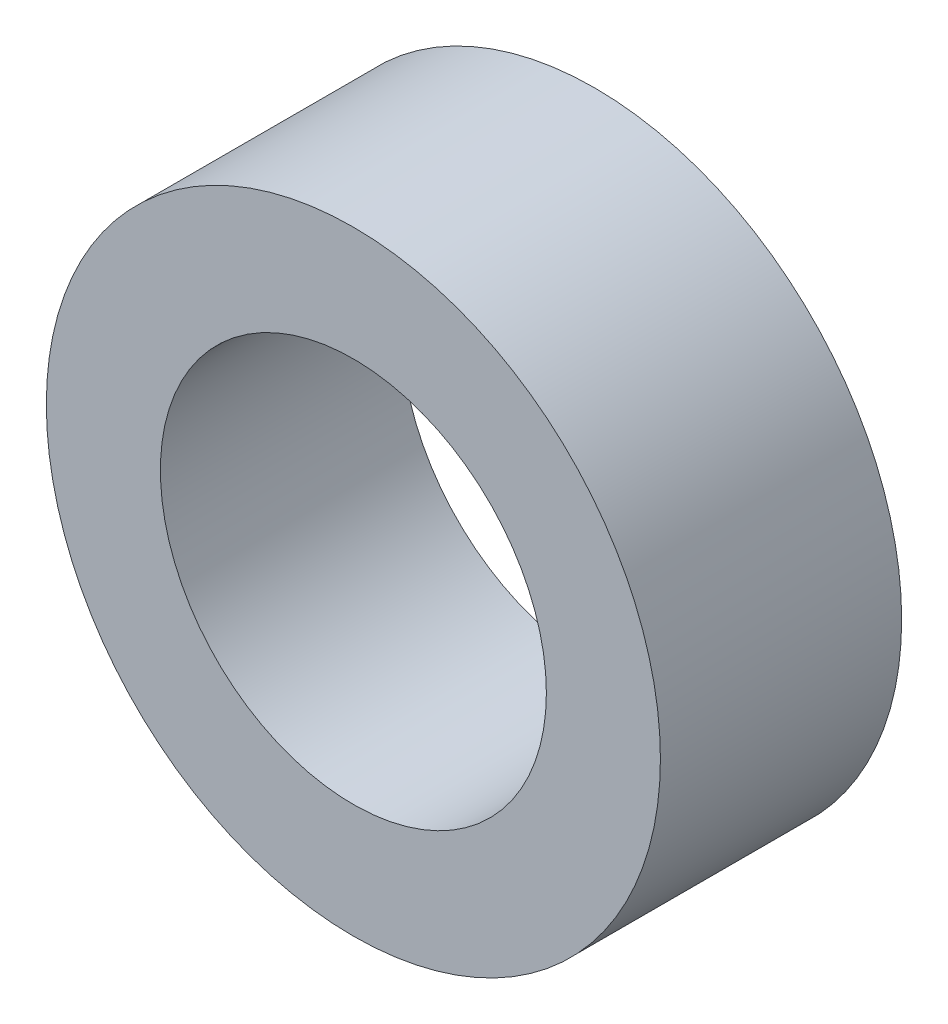
ISO-10303-21;
HEADER;
FILE_DESCRIPTION(('STEP AP214'),'2;1');
FILE_NAME('part.step','',(''),(''),'','','');
FILE_SCHEMA(('AUTOMOTIVE_DESIGN { 1 0 10303 214 1 1 1 1 }'));
ENDSEC;
DATA;
#1=APPLICATION_CONTEXT('core data for automotive mechanical design processes');
#2=APPLICATION_PROTOCOL_DEFINITION('international standard','automotive_design',2000,#1);
#3=PRODUCT_CONTEXT('',#1,'mechanical');
#4=PRODUCT('Part','Part','',(#3));
#5=PRODUCT_RELATED_PRODUCT_CATEGORY('part','',(#4));
#6=PRODUCT_DEFINITION_FORMATION('','',#4);
#7=PRODUCT_DEFINITION_CONTEXT('part definition',#1,'design');
#8=PRODUCT_DEFINITION('design','',#6,#7);
#9=PRODUCT_DEFINITION_SHAPE('','',#8);
#10=(LENGTH_UNIT() NAMED_UNIT(*) SI_UNIT(.MILLI.,.METRE.));
#11=(NAMED_UNIT(*) PLANE_ANGLE_UNIT() SI_UNIT($,.RADIAN.));
#12=(NAMED_UNIT(*) SI_UNIT($,.STERADIAN.) SOLID_ANGLE_UNIT());
#13=UNCERTAINTY_MEASURE_WITH_UNIT(LENGTH_MEASURE(1.E-05),#10,'distance_accuracy_value','');
#14=(GEOMETRIC_REPRESENTATION_CONTEXT(3) GLOBAL_UNCERTAINTY_ASSIGNED_CONTEXT((#13)) GLOBAL_UNIT_ASSIGNED_CONTEXT((#10,
#11,#12)) REPRESENTATION_CONTEXT('',''));
#15=CARTESIAN_POINT('',(0.,0.,0.));
#16=DIRECTION('',(0.,0.,1.));
#17=DIRECTION('',(1.,0.,0.));
#18=AXIS2_PLACEMENT_3D('',#15,#16,#17);
#19=CARTESIAN_POINT('',(0.,0.,25.2989899812233));
#20=DIRECTION('',(0.,0.,-1.));
#21=DIRECTION('',(-1.,0.,0.));
#22=AXIS2_PLACEMENT_3D('',#19,#20,#21);
#23=CYLINDRICAL_SURFACE('',#22,7.);
#24=CARTESIAN_POINT('',(0.,0.,0.));
#25=DIRECTION('',(0.,0.,1.));
#26=DIRECTION('',(1.,0.,0.));
#27=AXIS2_PLACEMENT_3D('',#24,#25,#26);
#28=CIRCLE('',#27,7.);
#29=CARTESIAN_POINT('',(7.,0.,0.));
#30=VERTEX_POINT('',#29);
#31=EDGE_CURVE('E46',#30,#30,#28,.T.);
#32=ORIENTED_EDGE('',*,*,#31,.T.);
#33=EDGE_LOOP('',(#32));
#34=FACE_BOUND('',#33,.T.);
#35=CARTESIAN_POINT('',(0.,0.,5.50000010799992));
#36=DIRECTION('',(0.,0.,1.));
#37=DIRECTION('',(1.,0.,0.));
#38=AXIS2_PLACEMENT_3D('',#35,#36,#37);
#39=CIRCLE('',#38,7.);
#40=CARTESIAN_POINT('',(7.,0.,5.50000010799992));
#41=VERTEX_POINT('',#40);
#42=EDGE_CURVE('E10',#41,#41,#39,.T.);
#43=ORIENTED_EDGE('',*,*,#42,.F.);
#44=EDGE_LOOP('',(#43));
#45=FACE_BOUND('',#44,.T.);
#46=ADVANCED_FACE('F32',(#34,#45),#23,.T.);
#47=CARTESIAN_POINT('',(0.,0.,0.));
#48=DIRECTION('',(0.,0.,1.));
#49=DIRECTION('',(1.,0.,0.));
#50=AXIS2_PLACEMENT_3D('',#47,#48,#49);
#51=PLANE('',#50);
#52=ORIENTED_EDGE('',*,*,#31,.F.);
#53=EDGE_LOOP('',(#52));
#54=FACE_BOUND('',#53,.T.);
#55=CARTESIAN_POINT('',(0.,0.,0.));
#56=DIRECTION('',(0.,0.,1.));
#57=DIRECTION('',(1.,0.,0.));
#58=AXIS2_PLACEMENT_3D('',#55,#56,#57);
#59=CIRCLE('',#58,4.4);
#60=CARTESIAN_POINT('',(4.4,0.,0.));
#61=VERTEX_POINT('',#60);
#62=EDGE_CURVE('E48',#61,#61,#59,.T.);
#63=ORIENTED_EDGE('',*,*,#62,.T.);
#64=EDGE_LOOP('',(#63));
#65=FACE_BOUND('',#64,.T.);
#66=ADVANCED_FACE('F56',(#54,#65),#51,.F.);
#67=CARTESIAN_POINT('',(0.,0.,25.2989899812233));
#68=DIRECTION('',(0.,0.,-1.));
#69=DIRECTION('',(-1.,0.,0.));
#70=AXIS2_PLACEMENT_3D('',#67,#68,#69);
#71=CYLINDRICAL_SURFACE('',#70,4.4);
#72=ORIENTED_EDGE('',*,*,#62,.F.);
#73=EDGE_LOOP('',(#72));
#74=FACE_BOUND('',#73,.T.);
#75=CARTESIAN_POINT('',(0.,0.,5.50000010799992));
#76=DIRECTION('',(0.,0.,1.));
#77=DIRECTION('',(1.,0.,0.));
#78=AXIS2_PLACEMENT_3D('',#75,#76,#77);
#79=CIRCLE('',#78,4.4);
#80=CARTESIAN_POINT('',(4.4,0.,5.50000010799992));
#81=VERTEX_POINT('',#80);
#82=EDGE_CURVE('E35',#81,#81,#79,.T.);
#83=ORIENTED_EDGE('',*,*,#82,.T.);
#84=EDGE_LOOP('',(#83));
#85=FACE_BOUND('',#84,.T.);
#86=ADVANCED_FACE('F59',(#74,#85),#71,.F.);
#87=CARTESIAN_POINT('',(0.,0.,5.50000010799992));
#88=DIRECTION('',(0.,0.,1.));
#89=DIRECTION('',(0.715792381041975,-0.698313158434137,0.));
#90=AXIS2_PLACEMENT_3D('',#87,#88,#89);
#91=PLANE('',#90);
#92=ORIENTED_EDGE('',*,*,#82,.F.);
#93=EDGE_LOOP('',(#92));
#94=FACE_BOUND('',#93,.T.);
#95=ORIENTED_EDGE('',*,*,#42,.T.);
#96=EDGE_LOOP('',(#95));
#97=FACE_BOUND('',#96,.T.);
#98=ADVANCED_FACE('F64',(#94,#97),#91,.T.);
#99=CLOSED_SHELL('',(#46,#66,#86,#98));
#100=MANIFOLD_SOLID_BREP('B2',#99);
#101=ADVANCED_BREP_SHAPE_REPRESENTATION('',(#18,#100),#14);
#102=SHAPE_DEFINITION_REPRESENTATION(#9,#101);
ENDSEC;
END-ISO-10303-21;
